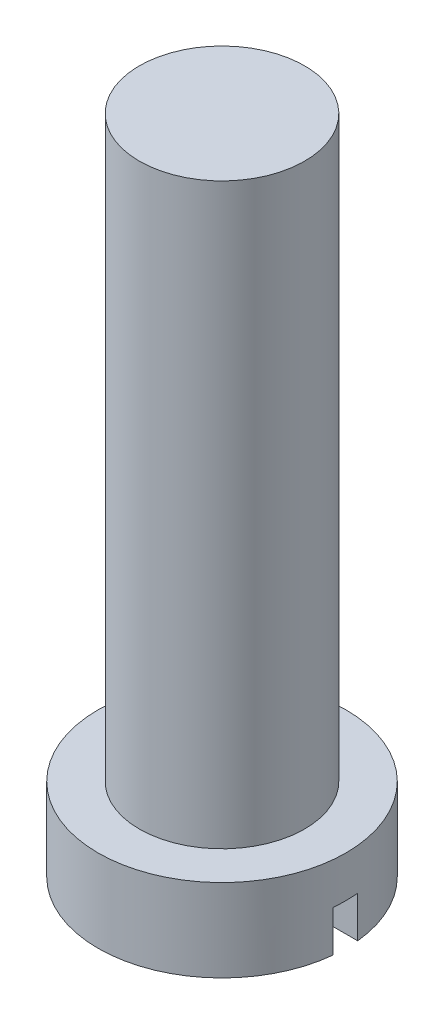
ISO-10303-21;
HEADER;
FILE_DESCRIPTION(('STEP AP214'),'2;1');
FILE_NAME('part.step','',(''),(''),'','','');
FILE_SCHEMA(('AUTOMOTIVE_DESIGN { 1 0 10303 214 1 1 1 1 }'));
ENDSEC;
DATA;
#1=APPLICATION_CONTEXT('core data for automotive mechanical design processes');
#2=APPLICATION_PROTOCOL_DEFINITION('international standard','automotive_design',2000,#1);
#3=PRODUCT_CONTEXT('',#1,'mechanical');
#4=PRODUCT('Part','Part','',(#3));
#5=PRODUCT_RELATED_PRODUCT_CATEGORY('part','',(#4));
#6=PRODUCT_DEFINITION_FORMATION('','',#4);
#7=PRODUCT_DEFINITION_CONTEXT('part definition',#1,'design');
#8=PRODUCT_DEFINITION('design','',#6,#7);
#9=PRODUCT_DEFINITION_SHAPE('','',#8);
#10=(LENGTH_UNIT() NAMED_UNIT(*) SI_UNIT(.MILLI.,.METRE.));
#11=(NAMED_UNIT(*) PLANE_ANGLE_UNIT() SI_UNIT($,.RADIAN.));
#12=(NAMED_UNIT(*) SI_UNIT($,.STERADIAN.) SOLID_ANGLE_UNIT());
#13=UNCERTAINTY_MEASURE_WITH_UNIT(LENGTH_MEASURE(1.E-05),#10,'distance_accuracy_value','');
#14=(GEOMETRIC_REPRESENTATION_CONTEXT(3) GLOBAL_UNCERTAINTY_ASSIGNED_CONTEXT((#13)) GLOBAL_UNIT_ASSIGNED_CONTEXT((#10,
#11,#12)) REPRESENTATION_CONTEXT('',''));
#15=CARTESIAN_POINT('',(0.,0.,0.));
#16=DIRECTION('',(0.,0.,1.));
#17=DIRECTION('',(1.,0.,0.));
#18=AXIS2_PLACEMENT_3D('',#15,#16,#17);
#19=CARTESIAN_POINT('',(0.,0.,0.));
#20=DIRECTION('',(0.,1.,0.));
#21=DIRECTION('',(0.,0.,1.));
#22=AXIS2_PLACEMENT_3D('',#19,#20,#21);
#23=PLANE('',#22);
#24=CARTESIAN_POINT('',(0.,0.,0.));
#25=DIRECTION('',(0.,1.,0.));
#26=DIRECTION('',(0.,0.,1.));
#27=AXIS2_PLACEMENT_3D('',#24,#25,#26);
#28=CIRCLE('',#27,3.);
#29=CARTESIAN_POINT('',(2.98496231131986,0.,-0.3));
#30=VERTEX_POINT('',#29);
#31=CARTESIAN_POINT('',(-2.98496231131986,0.,-0.3));
#32=VERTEX_POINT('',#31);
#33=EDGE_CURVE('E102',#30,#32,#28,.T.);
#34=ORIENTED_EDGE('',*,*,#33,.F.);
#35=DIRECTION('',(-1.,0.,0.));
#36=VECTOR('',#35,1.);
#37=CARTESIAN_POINT('',(0.,0.,-0.3));
#38=LINE('',#37,#36);
#39=EDGE_CURVE('E89',#30,#32,#38,.T.);
#40=ORIENTED_EDGE('',*,*,#39,.T.);
#41=EDGE_LOOP('',(#34,#40));
#42=FACE_BOUND('',#41,.T.);
#43=ADVANCED_FACE('F39',(#42),#23,.F.);
#44=CARTESIAN_POINT('',(0.,2.,0.));
#45=DIRECTION('',(0.,-1.,0.));
#46=DIRECTION('',(0.,0.,-1.));
#47=AXIS2_PLACEMENT_3D('',#44,#45,#46);
#48=CYLINDRICAL_SURFACE('',#47,3.);
#49=CARTESIAN_POINT('',(0.,1.,0.));
#50=DIRECTION('',(0.,1.,0.));
#51=DIRECTION('',(0.,0.,1.));
#52=AXIS2_PLACEMENT_3D('',#49,#50,#51);
#53=CIRCLE('',#52,3.);
#54=CARTESIAN_POINT('',(2.98496231131986,1.,0.3));
#55=VERTEX_POINT('',#54);
#56=CARTESIAN_POINT('',(2.98496231131986,1.,-0.3));
#57=VERTEX_POINT('',#56);
#58=EDGE_CURVE('E11',#55,#57,#53,.T.);
#59=ORIENTED_EDGE('',*,*,#58,.T.);
#60=DIRECTION('',(0.,-1.,0.));
#61=VECTOR('',#60,1.);
#62=CARTESIAN_POINT('',(2.98496231131986,2.,-0.3));
#63=LINE('',#62,#61);
#64=EDGE_CURVE('E63',#57,#30,#63,.T.);
#65=ORIENTED_EDGE('',*,*,#64,.T.);
#66=ORIENTED_EDGE('',*,*,#33,.T.);
#67=DIRECTION('',(0.,-1.,0.));
#68=VECTOR('',#67,1.);
#69=CARTESIAN_POINT('',(-2.98496231131986,2.,-0.3));
#70=LINE('',#69,#68);
#71=CARTESIAN_POINT('',(-2.98496231131986,1.,-0.3));
#72=VERTEX_POINT('',#71);
#73=EDGE_CURVE('E98',#32,#72,#70,.F.);
#74=ORIENTED_EDGE('',*,*,#73,.T.);
#75=CARTESIAN_POINT('',(-2.98496231131986,1.,0.3));
#76=VERTEX_POINT('',#75);
#77=EDGE_CURVE('E43',#72,#76,#53,.T.);
#78=ORIENTED_EDGE('',*,*,#77,.T.);
#79=DIRECTION('',(0.,-1.,0.));
#80=VECTOR('',#79,1.);
#81=CARTESIAN_POINT('',(-2.98496231131986,2.,0.3));
#82=LINE('',#81,#80);
#83=CARTESIAN_POINT('',(-2.98496231131986,0.,0.3));
#84=VERTEX_POINT('',#83);
#85=EDGE_CURVE('E83',#76,#84,#82,.T.);
#86=ORIENTED_EDGE('',*,*,#85,.T.);
#87=CARTESIAN_POINT('',(2.98496231131986,0.,0.3));
#88=VERTEX_POINT('',#87);
#89=EDGE_CURVE('E95',#84,#88,#28,.T.);
#90=ORIENTED_EDGE('',*,*,#89,.T.);
#91=DIRECTION('',(0.,-1.,0.));
#92=VECTOR('',#91,1.);
#93=CARTESIAN_POINT('',(2.98496231131986,2.,0.3));
#94=LINE('',#93,#92);
#95=EDGE_CURVE('E55',#88,#55,#94,.F.);
#96=ORIENTED_EDGE('',*,*,#95,.T.);
#97=EDGE_LOOP('',(#59,#65,#66,#74,#78,#86,#90,#96));
#98=FACE_BOUND('',#97,.T.);
#99=CARTESIAN_POINT('',(0.,2.,0.));
#100=DIRECTION('',(0.,1.,0.));
#101=DIRECTION('',(0.,0.,1.));
#102=AXIS2_PLACEMENT_3D('',#99,#100,#101);
#103=CIRCLE('',#102,3.);
#104=CARTESIAN_POINT('',(0.,2.,3.));
#105=VERTEX_POINT('',#104);
#106=EDGE_CURVE('E108',#105,#105,#103,.T.);
#107=ORIENTED_EDGE('',*,*,#106,.F.);
#108=EDGE_LOOP('',(#107));
#109=FACE_BOUND('',#108,.T.);
#110=ADVANCED_FACE('F41',(#98,#109),#48,.T.);
#111=CARTESIAN_POINT('',(0.,2.,0.));
#112=DIRECTION('',(0.,1.,0.));
#113=DIRECTION('',(0.,0.,1.));
#114=AXIS2_PLACEMENT_3D('',#111,#112,#113);
#115=PLANE('',#114);
#116=CARTESIAN_POINT('',(0.,2.,0.));
#117=DIRECTION('',(0.,1.,0.));
#118=DIRECTION('',(0.,0.,1.));
#119=AXIS2_PLACEMENT_3D('',#116,#117,#118);
#120=CIRCLE('',#119,2.);
#121=CARTESIAN_POINT('',(0.,2.,2.));
#122=VERTEX_POINT('',#121);
#123=EDGE_CURVE('E90',#122,#122,#120,.T.);
#124=ORIENTED_EDGE('',*,*,#123,.F.);
#125=EDGE_LOOP('',(#124));
#126=FACE_BOUND('',#125,.T.);
#127=ORIENTED_EDGE('',*,*,#106,.T.);
#128=EDGE_LOOP('',(#127));
#129=FACE_BOUND('',#128,.T.);
#130=ADVANCED_FACE('F130',(#126,#129),#115,.T.);
#131=ORIENTED_EDGE('',*,*,#89,.F.);
#132=DIRECTION('',(1.,0.,0.));
#133=VECTOR('',#132,1.);
#134=CARTESIAN_POINT('',(0.,0.,0.3));
#135=LINE('',#134,#133);
#136=EDGE_CURVE('E80',#84,#88,#135,.T.);
#137=ORIENTED_EDGE('',*,*,#136,.T.);
#138=EDGE_LOOP('',(#131,#137));
#139=FACE_BOUND('',#138,.T.);
#140=ADVANCED_FACE('F100',(#139),#23,.F.);
#141=CARTESIAN_POINT('',(0.,16.,0.));
#142=DIRECTION('',(0.,-1.,0.));
#143=DIRECTION('',(0.,0.,-1.));
#144=AXIS2_PLACEMENT_3D('',#141,#142,#143);
#145=CYLINDRICAL_SURFACE('',#144,2.);
#146=CARTESIAN_POINT('',(0.,16.,0.));
#147=DIRECTION('',(0.,1.,0.));
#148=DIRECTION('',(0.,0.,1.));
#149=AXIS2_PLACEMENT_3D('',#146,#147,#148);
#150=CIRCLE('',#149,2.);
#151=CARTESIAN_POINT('',(0.,16.,2.));
#152=VERTEX_POINT('',#151);
#153=EDGE_CURVE('E103',#152,#152,#150,.T.);
#154=ORIENTED_EDGE('',*,*,#153,.F.);
#155=EDGE_LOOP('',(#154));
#156=FACE_BOUND('',#155,.T.);
#157=ORIENTED_EDGE('',*,*,#123,.T.);
#158=EDGE_LOOP('',(#157));
#159=FACE_BOUND('',#158,.T.);
#160=ADVANCED_FACE('F141',(#156,#159),#145,.T.);
#161=CARTESIAN_POINT('',(0.,16.,0.));
#162=DIRECTION('',(0.,1.,0.));
#163=DIRECTION('',(0.,0.,1.));
#164=AXIS2_PLACEMENT_3D('',#161,#162,#163);
#165=PLANE('',#164);
#166=ORIENTED_EDGE('',*,*,#153,.T.);
#167=EDGE_LOOP('',(#166));
#168=FACE_BOUND('',#167,.T.);
#169=ADVANCED_FACE('F145',(#168),#165,.T.);
#170=CARTESIAN_POINT('',(0.,1.,0.));
#171=DIRECTION('',(0.,1.,0.));
#172=DIRECTION('',(0.,0.,1.));
#173=AXIS2_PLACEMENT_3D('',#170,#171,#172);
#174=PLANE('',#173);
#175=DIRECTION('',(-1.,0.,0.));
#176=VECTOR('',#175,1.);
#177=CARTESIAN_POINT('',(0.,1.,0.3));
#178=LINE('',#177,#176);
#179=EDGE_CURVE('E165',#55,#76,#178,.T.);
#180=ORIENTED_EDGE('',*,*,#179,.T.);
#181=ORIENTED_EDGE('',*,*,#77,.F.);
#182=DIRECTION('',(1.,0.,0.));
#183=VECTOR('',#182,1.);
#184=CARTESIAN_POINT('',(0.,1.,-0.3));
#185=LINE('',#184,#183);
#186=EDGE_CURVE('E167',#72,#57,#185,.T.);
#187=ORIENTED_EDGE('',*,*,#186,.T.);
#188=ORIENTED_EDGE('',*,*,#58,.F.);
#189=EDGE_LOOP('',(#180,#181,#187,#188));
#190=FACE_BOUND('',#189,.T.);
#191=ADVANCED_FACE('F151',(#190),#174,.F.);
#192=CARTESIAN_POINT('',(0.,1.,-0.3));
#193=DIRECTION('',(0.,0.,-1.));
#194=DIRECTION('',(-1.,0.,0.));
#195=AXIS2_PLACEMENT_3D('',#192,#193,#194);
#196=PLANE('',#195);
#197=ORIENTED_EDGE('',*,*,#186,.F.);
#198=ORIENTED_EDGE('',*,*,#73,.F.);
#199=ORIENTED_EDGE('',*,*,#39,.F.);
#200=ORIENTED_EDGE('',*,*,#64,.F.);
#201=EDGE_LOOP('',(#197,#198,#199,#200));
#202=FACE_BOUND('',#201,.T.);
#203=ADVANCED_FACE('F158',(#202),#196,.F.);
#204=CARTESIAN_POINT('',(0.,1.,0.3));
#205=DIRECTION('',(0.,0.,1.));
#206=DIRECTION('',(1.,0.,0.));
#207=AXIS2_PLACEMENT_3D('',#204,#205,#206);
#208=PLANE('',#207);
#209=ORIENTED_EDGE('',*,*,#179,.F.);
#210=ORIENTED_EDGE('',*,*,#95,.F.);
#211=ORIENTED_EDGE('',*,*,#136,.F.);
#212=ORIENTED_EDGE('',*,*,#85,.F.);
#213=EDGE_LOOP('',(#209,#210,#211,#212));
#214=FACE_BOUND('',#213,.T.);
#215=ADVANCED_FACE('F82',(#214),#208,.F.);
#216=CLOSED_SHELL('',(#43,#110,#130,#140,#160,#169,#191,#203,#215));
#217=MANIFOLD_SOLID_BREP('B2',#216);
#218=ADVANCED_BREP_SHAPE_REPRESENTATION('',(#18,#217),#14);
#219=SHAPE_DEFINITION_REPRESENTATION(#9,#218);
ENDSEC;
END-ISO-10303-21;
